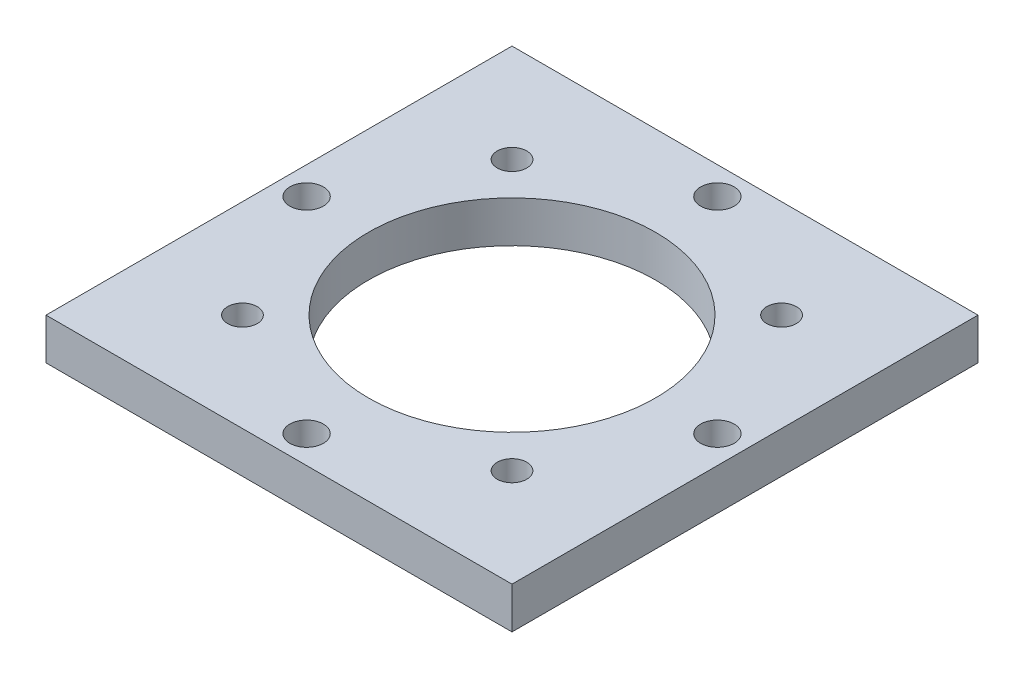
ISO-10303-21;
HEADER;
FILE_DESCRIPTION(('STEP AP214'),'2;1');
FILE_NAME('part.step','',(''),(''),'','','');
FILE_SCHEMA(('AUTOMOTIVE_DESIGN { 1 0 10303 214 1 1 1 1 }'));
ENDSEC;
DATA;
#1=APPLICATION_CONTEXT('core data for automotive mechanical design processes');
#2=APPLICATION_PROTOCOL_DEFINITION('international standard','automotive_design',2000,#1);
#3=PRODUCT_CONTEXT('',#1,'mechanical');
#4=PRODUCT('Part','Part','',(#3));
#5=PRODUCT_RELATED_PRODUCT_CATEGORY('part','',(#4));
#6=PRODUCT_DEFINITION_FORMATION('','',#4);
#7=PRODUCT_DEFINITION_CONTEXT('part definition',#1,'design');
#8=PRODUCT_DEFINITION('design','',#6,#7);
#9=PRODUCT_DEFINITION_SHAPE('','',#8);
#10=(LENGTH_UNIT() NAMED_UNIT(*) SI_UNIT(.MILLI.,.METRE.));
#11=(NAMED_UNIT(*) PLANE_ANGLE_UNIT() SI_UNIT($,.RADIAN.));
#12=(NAMED_UNIT(*) SI_UNIT($,.STERADIAN.) SOLID_ANGLE_UNIT());
#13=UNCERTAINTY_MEASURE_WITH_UNIT(LENGTH_MEASURE(1.E-05),#10,'distance_accuracy_value','');
#14=(GEOMETRIC_REPRESENTATION_CONTEXT(3) GLOBAL_UNCERTAINTY_ASSIGNED_CONTEXT((#13)) GLOBAL_UNIT_ASSIGNED_CONTEXT((#10,
#11,#12)) REPRESENTATION_CONTEXT('',''));
#15=CARTESIAN_POINT('',(0.,0.,0.));
#16=DIRECTION('',(0.,0.,1.));
#17=DIRECTION('',(1.,0.,0.));
#18=AXIS2_PLACEMENT_3D('',#15,#16,#17);
#19=CARTESIAN_POINT('',(0.,4.7625,0.));
#20=DIRECTION('',(0.,-1.,0.));
#21=DIRECTION('',(0.,0.,-1.));
#22=AXIS2_PLACEMENT_3D('',#19,#20,#21);
#23=PLANE('',#22);
#24=CARTESIAN_POINT('',(1.42049912535143E-12,4.7625,23.622));
#25=DIRECTION('',(0.,1.,0.));
#26=DIRECTION('',(0.,0.,1.));
#27=AXIS2_PLACEMENT_3D('',#24,#25,#26);
#28=CIRCLE('',#27,1.92664959529837);
#29=CARTESIAN_POINT('',(1.42049912535143E-12,4.7625,25.5486495952984));
#30=VERTEX_POINT('',#29);
#31=EDGE_CURVE('E160',#30,#30,#28,.T.);
#32=ORIENTED_EDGE('',*,*,#31,.F.);
#33=EDGE_LOOP('',(#32));
#34=FACE_BOUND('',#33,.T.);
#35=CARTESIAN_POINT('',(0.,4.7625,-23.622));
#36=DIRECTION('',(0.,1.,0.));
#37=DIRECTION('',(0.,0.,1.));
#38=AXIS2_PLACEMENT_3D('',#35,#36,#37);
#39=CIRCLE('',#38,1.92664959529838);
#40=CARTESIAN_POINT('',(0.,4.7625,-21.6953504047016));
#41=VERTEX_POINT('',#40);
#42=EDGE_CURVE('E146',#41,#41,#39,.T.);
#43=ORIENTED_EDGE('',*,*,#42,.F.);
#44=EDGE_LOOP('',(#43));
#45=FACE_BOUND('',#44,.T.);
#46=CARTESIAN_POINT('',(15.5,4.7625,15.5));
#47=DIRECTION('',(0.,1.,0.));
#48=DIRECTION('',(0.,0.,1.));
#49=AXIS2_PLACEMENT_3D('',#46,#47,#48);
#50=CIRCLE('',#49,1.7);
#51=CARTESIAN_POINT('',(15.5,4.7625,17.2));
#52=VERTEX_POINT('',#51);
#53=EDGE_CURVE('E133',#52,#52,#50,.T.);
#54=ORIENTED_EDGE('',*,*,#53,.F.);
#55=EDGE_LOOP('',(#54));
#56=FACE_BOUND('',#55,.T.);
#57=CARTESIAN_POINT('',(-15.5,4.7625,-15.5));
#58=DIRECTION('',(0.,1.,0.));
#59=DIRECTION('',(0.,0.,1.));
#60=AXIS2_PLACEMENT_3D('',#57,#58,#59);
#61=CIRCLE('',#60,1.7);
#62=CARTESIAN_POINT('',(-15.5,4.7625,-13.8));
#63=VERTEX_POINT('',#62);
#64=EDGE_CURVE('E121',#63,#63,#61,.T.);
#65=ORIENTED_EDGE('',*,*,#64,.F.);
#66=EDGE_LOOP('',(#65));
#67=FACE_BOUND('',#66,.T.);
#68=DIRECTION('',(0.,0.,-1.));
#69=VECTOR('',#68,1.);
#70=CARTESIAN_POINT('',(26.797,4.7625,26.797));
#71=LINE('',#70,#69);
#72=CARTESIAN_POINT('',(26.797,4.7625,26.797));
#73=VERTEX_POINT('',#72);
#74=CARTESIAN_POINT('',(26.797,4.7625,-26.797));
#75=VERTEX_POINT('',#74);
#76=EDGE_CURVE('E84',#73,#75,#71,.T.);
#77=ORIENTED_EDGE('',*,*,#76,.T.);
#78=DIRECTION('',(-1.,0.,0.));
#79=VECTOR('',#78,1.);
#80=CARTESIAN_POINT('',(-26.797,4.7625,-26.797));
#81=LINE('',#80,#79);
#82=CARTESIAN_POINT('',(-26.797,4.7625,-26.797));
#83=VERTEX_POINT('',#82);
#84=EDGE_CURVE('E79',#75,#83,#81,.T.);
#85=ORIENTED_EDGE('',*,*,#84,.T.);
#86=DIRECTION('',(0.,0.,1.));
#87=VECTOR('',#86,1.);
#88=CARTESIAN_POINT('',(-26.797,4.7625,26.797));
#89=LINE('',#88,#87);
#90=CARTESIAN_POINT('',(-26.797,4.7625,26.797));
#91=VERTEX_POINT('',#90);
#92=EDGE_CURVE('E82',#83,#91,#89,.T.);
#93=ORIENTED_EDGE('',*,*,#92,.T.);
#94=DIRECTION('',(1.,0.,0.));
#95=VECTOR('',#94,1.);
#96=CARTESIAN_POINT('',(-26.797,4.7625,26.797));
#97=LINE('',#96,#95);
#98=EDGE_CURVE('E49',#91,#73,#97,.T.);
#99=ORIENTED_EDGE('',*,*,#98,.T.);
#100=EDGE_LOOP('',(#77,#85,#93,#99));
#101=FACE_BOUND('',#100,.T.);
#102=CARTESIAN_POINT('',(0.,4.7625,0.));
#103=DIRECTION('',(0.,1.,0.));
#104=DIRECTION('',(0.,0.,1.));
#105=AXIS2_PLACEMENT_3D('',#102,#103,#104);
#106=CIRCLE('',#105,16.51);
#107=CARTESIAN_POINT('',(0.,4.7625,16.51));
#108=VERTEX_POINT('',#107);
#109=EDGE_CURVE('E104',#108,#108,#106,.T.);
#110=ORIENTED_EDGE('',*,*,#109,.F.);
#111=EDGE_LOOP('',(#110));
#112=FACE_BOUND('',#111,.T.);
#113=CARTESIAN_POINT('',(15.5,4.7625,-15.5));
#114=DIRECTION('',(0.,1.,0.));
#115=DIRECTION('',(0.,0.,1.));
#116=AXIS2_PLACEMENT_3D('',#113,#114,#115);
#117=CIRCLE('',#116,1.7);
#118=CARTESIAN_POINT('',(15.5,4.7625,-13.8));
#119=VERTEX_POINT('',#118);
#120=EDGE_CURVE('E127',#119,#119,#117,.T.);
#121=ORIENTED_EDGE('',*,*,#120,.F.);
#122=EDGE_LOOP('',(#121));
#123=FACE_BOUND('',#122,.T.);
#124=CARTESIAN_POINT('',(-15.5,4.7625,15.5));
#125=DIRECTION('',(0.,1.,0.));
#126=DIRECTION('',(0.,0.,1.));
#127=AXIS2_PLACEMENT_3D('',#124,#125,#126);
#128=CIRCLE('',#127,1.7);
#129=CARTESIAN_POINT('',(-15.5,4.7625,17.2));
#130=VERTEX_POINT('',#129);
#131=EDGE_CURVE('E139',#130,#130,#128,.T.);
#132=ORIENTED_EDGE('',*,*,#131,.F.);
#133=EDGE_LOOP('',(#132));
#134=FACE_BOUND('',#133,.T.);
#135=CARTESIAN_POINT('',(23.6220000000007,4.7625,-7.12396282621754E-13));
#136=DIRECTION('',(0.,1.,0.));
#137=DIRECTION('',(0.,0.,1.));
#138=AXIS2_PLACEMENT_3D('',#135,#136,#137);
#139=CIRCLE('',#138,1.92664959529838);
#140=CARTESIAN_POINT('',(23.6220000000007,4.7625,1.92664959529766));
#141=VERTEX_POINT('',#140);
#142=EDGE_CURVE('E153',#141,#141,#139,.T.);
#143=ORIENTED_EDGE('',*,*,#142,.F.);
#144=EDGE_LOOP('',(#143));
#145=FACE_BOUND('',#144,.T.);
#146=CARTESIAN_POINT('',(-23.6219999999993,4.7625,7.152891432907E-13));
#147=DIRECTION('',(0.,1.,0.));
#148=DIRECTION('',(0.,0.,1.));
#149=AXIS2_PLACEMENT_3D('',#146,#147,#148);
#150=CIRCLE('',#149,1.92664959529838);
#151=CARTESIAN_POINT('',(-23.6219999999993,4.7625,1.92664959529909));
#152=VERTEX_POINT('',#151);
#153=EDGE_CURVE('E167',#152,#152,#150,.T.);
#154=ORIENTED_EDGE('',*,*,#153,.F.);
#155=EDGE_LOOP('',(#154));
#156=FACE_BOUND('',#155,.T.);
#157=ADVANCED_FACE('F32',(#34,#45,#56,#67,#101,#112,#123,#134,#145,#156),#23,.F.);
#158=CARTESIAN_POINT('',(0.,0.,0.));
#159=DIRECTION('',(0.,-1.,0.));
#160=DIRECTION('',(0.,0.,-1.));
#161=AXIS2_PLACEMENT_3D('',#158,#159,#160);
#162=PLANE('',#161);
#163=CARTESIAN_POINT('',(1.42049912535143E-12,0.,23.622));
#164=DIRECTION('',(0.,1.,0.));
#165=DIRECTION('',(0.,0.,1.));
#166=AXIS2_PLACEMENT_3D('',#163,#164,#165);
#167=CIRCLE('',#166,1.92664959529837);
#168=CARTESIAN_POINT('',(1.42049912535143E-12,0.,25.5486495952984));
#169=VERTEX_POINT('',#168);
#170=EDGE_CURVE('E163',#169,#169,#167,.T.);
#171=ORIENTED_EDGE('',*,*,#170,.T.);
#172=EDGE_LOOP('',(#171));
#173=FACE_BOUND('',#172,.T.);
#174=CARTESIAN_POINT('',(0.,0.,-23.622));
#175=DIRECTION('',(0.,1.,0.));
#176=DIRECTION('',(0.,0.,1.));
#177=AXIS2_PLACEMENT_3D('',#174,#175,#176);
#178=CIRCLE('',#177,1.92664959529838);
#179=CARTESIAN_POINT('',(0.,0.,-21.6953504047016));
#180=VERTEX_POINT('',#179);
#181=EDGE_CURVE('E149',#180,#180,#178,.T.);
#182=ORIENTED_EDGE('',*,*,#181,.T.);
#183=EDGE_LOOP('',(#182));
#184=FACE_BOUND('',#183,.T.);
#185=CARTESIAN_POINT('',(15.5,0.,15.5));
#186=DIRECTION('',(0.,1.,0.));
#187=DIRECTION('',(0.,0.,1.));
#188=AXIS2_PLACEMENT_3D('',#185,#186,#187);
#189=CIRCLE('',#188,1.7);
#190=CARTESIAN_POINT('',(15.5,0.,17.2));
#191=VERTEX_POINT('',#190);
#192=EDGE_CURVE('E136',#191,#191,#189,.T.);
#193=ORIENTED_EDGE('',*,*,#192,.T.);
#194=EDGE_LOOP('',(#193));
#195=FACE_BOUND('',#194,.T.);
#196=CARTESIAN_POINT('',(-15.5,0.,-15.5));
#197=DIRECTION('',(0.,1.,0.));
#198=DIRECTION('',(0.,0.,1.));
#199=AXIS2_PLACEMENT_3D('',#196,#197,#198);
#200=CIRCLE('',#199,1.7);
#201=CARTESIAN_POINT('',(-15.5,0.,-13.8));
#202=VERTEX_POINT('',#201);
#203=EDGE_CURVE('E124',#202,#202,#200,.T.);
#204=ORIENTED_EDGE('',*,*,#203,.T.);
#205=EDGE_LOOP('',(#204));
#206=FACE_BOUND('',#205,.T.);
#207=DIRECTION('',(0.,0.,-1.));
#208=VECTOR('',#207,1.);
#209=CARTESIAN_POINT('',(26.797,0.,26.797));
#210=LINE('',#209,#208);
#211=CARTESIAN_POINT('',(26.797,0.,26.797));
#212=VERTEX_POINT('',#211);
#213=CARTESIAN_POINT('',(26.797,0.,-26.797));
#214=VERTEX_POINT('',#213);
#215=EDGE_CURVE('E100',#212,#214,#210,.T.);
#216=ORIENTED_EDGE('',*,*,#215,.F.);
#217=DIRECTION('',(1.,0.,0.));
#218=VECTOR('',#217,1.);
#219=CARTESIAN_POINT('',(-26.797,0.,26.797));
#220=LINE('',#219,#218);
#221=CARTESIAN_POINT('',(-26.797,0.,26.797));
#222=VERTEX_POINT('',#221);
#223=EDGE_CURVE('E72',#222,#212,#220,.T.);
#224=ORIENTED_EDGE('',*,*,#223,.F.);
#225=DIRECTION('',(0.,0.,1.));
#226=VECTOR('',#225,1.);
#227=CARTESIAN_POINT('',(-26.797,0.,26.797));
#228=LINE('',#227,#226);
#229=CARTESIAN_POINT('',(-26.797,0.,-26.797));
#230=VERTEX_POINT('',#229);
#231=EDGE_CURVE('E66',#230,#222,#228,.T.);
#232=ORIENTED_EDGE('',*,*,#231,.F.);
#233=DIRECTION('',(-1.,0.,0.));
#234=VECTOR('',#233,1.);
#235=CARTESIAN_POINT('',(-26.797,0.,-26.797));
#236=LINE('',#235,#234);
#237=EDGE_CURVE('E88',#214,#230,#236,.T.);
#238=ORIENTED_EDGE('',*,*,#237,.F.);
#239=EDGE_LOOP('',(#216,#224,#232,#238));
#240=FACE_BOUND('',#239,.T.);
#241=CARTESIAN_POINT('',(0.,0.,0.));
#242=DIRECTION('',(0.,1.,0.));
#243=DIRECTION('',(0.,0.,1.));
#244=AXIS2_PLACEMENT_3D('',#241,#242,#243);
#245=CIRCLE('',#244,16.51);
#246=CARTESIAN_POINT('',(0.,0.,16.51));
#247=VERTEX_POINT('',#246);
#248=EDGE_CURVE('E118',#247,#247,#245,.T.);
#249=ORIENTED_EDGE('',*,*,#248,.T.);
#250=EDGE_LOOP('',(#249));
#251=FACE_BOUND('',#250,.T.);
#252=CARTESIAN_POINT('',(15.5,0.,-15.5));
#253=DIRECTION('',(0.,1.,0.));
#254=DIRECTION('',(0.,0.,1.));
#255=AXIS2_PLACEMENT_3D('',#252,#253,#254);
#256=CIRCLE('',#255,1.7);
#257=CARTESIAN_POINT('',(15.5,0.,-13.8));
#258=VERTEX_POINT('',#257);
#259=EDGE_CURVE('E130',#258,#258,#256,.T.);
#260=ORIENTED_EDGE('',*,*,#259,.T.);
#261=EDGE_LOOP('',(#260));
#262=FACE_BOUND('',#261,.T.);
#263=CARTESIAN_POINT('',(-15.5,0.,15.5));
#264=DIRECTION('',(0.,1.,0.));
#265=DIRECTION('',(0.,0.,1.));
#266=AXIS2_PLACEMENT_3D('',#263,#264,#265);
#267=CIRCLE('',#266,1.7);
#268=CARTESIAN_POINT('',(-15.5,0.,17.2));
#269=VERTEX_POINT('',#268);
#270=EDGE_CURVE('E143',#269,#269,#267,.T.);
#271=ORIENTED_EDGE('',*,*,#270,.T.);
#272=EDGE_LOOP('',(#271));
#273=FACE_BOUND('',#272,.T.);
#274=CARTESIAN_POINT('',(23.6220000000007,0.,-7.12396282621754E-13));
#275=DIRECTION('',(0.,1.,0.));
#276=DIRECTION('',(0.,0.,1.));
#277=AXIS2_PLACEMENT_3D('',#274,#275,#276);
#278=CIRCLE('',#277,1.92664959529838);
#279=CARTESIAN_POINT('',(23.6220000000007,0.,1.92664959529766));
#280=VERTEX_POINT('',#279);
#281=EDGE_CURVE('E156',#280,#280,#278,.T.);
#282=ORIENTED_EDGE('',*,*,#281,.T.);
#283=EDGE_LOOP('',(#282));
#284=FACE_BOUND('',#283,.T.);
#285=CARTESIAN_POINT('',(-23.6219999999993,0.,7.152891432907E-13));
#286=DIRECTION('',(0.,1.,0.));
#287=DIRECTION('',(0.,0.,1.));
#288=AXIS2_PLACEMENT_3D('',#285,#286,#287);
#289=CIRCLE('',#288,1.92664959529838);
#290=CARTESIAN_POINT('',(-23.6219999999993,0.,1.92664959529909));
#291=VERTEX_POINT('',#290);
#292=EDGE_CURVE('E170',#291,#291,#289,.T.);
#293=ORIENTED_EDGE('',*,*,#292,.T.);
#294=EDGE_LOOP('',(#293));
#295=FACE_BOUND('',#294,.T.);
#296=ADVANCED_FACE('F114',(#173,#184,#195,#206,#240,#251,#262,#273,#284,#295),#162,.T.);
#297=CARTESIAN_POINT('',(26.797,4.7625,26.797));
#298=DIRECTION('',(-1.,0.,0.));
#299=DIRECTION('',(0.,0.,1.));
#300=AXIS2_PLACEMENT_3D('',#297,#298,#299);
#301=PLANE('',#300);
#302=ORIENTED_EDGE('',*,*,#215,.T.);
#303=DIRECTION('',(0.,-1.,0.));
#304=VECTOR('',#303,1.);
#305=CARTESIAN_POINT('',(26.797,4.7625,-26.797));
#306=LINE('',#305,#304);
#307=EDGE_CURVE('E11',#75,#214,#306,.T.);
#308=ORIENTED_EDGE('',*,*,#307,.F.);
#309=ORIENTED_EDGE('',*,*,#76,.F.);
#310=DIRECTION('',(0.,-1.,0.));
#311=VECTOR('',#310,1.);
#312=CARTESIAN_POINT('',(26.797,4.7625,26.797));
#313=LINE('',#312,#311);
#314=EDGE_CURVE('E96',#73,#212,#313,.T.);
#315=ORIENTED_EDGE('',*,*,#314,.T.);
#316=EDGE_LOOP('',(#302,#308,#309,#315));
#317=FACE_BOUND('',#316,.T.);
#318=ADVANCED_FACE('F34',(#317),#301,.F.);
#319=CARTESIAN_POINT('',(-26.797,4.7625,-26.797));
#320=DIRECTION('',(0.,0.,1.));
#321=DIRECTION('',(1.,0.,0.));
#322=AXIS2_PLACEMENT_3D('',#319,#320,#321);
#323=PLANE('',#322);
#324=ORIENTED_EDGE('',*,*,#237,.T.);
#325=DIRECTION('',(0.,-1.,0.));
#326=VECTOR('',#325,1.);
#327=CARTESIAN_POINT('',(-26.797,4.7625,-26.797));
#328=LINE('',#327,#326);
#329=EDGE_CURVE('E41',#83,#230,#328,.T.);
#330=ORIENTED_EDGE('',*,*,#329,.F.);
#331=ORIENTED_EDGE('',*,*,#84,.F.);
#332=ORIENTED_EDGE('',*,*,#307,.T.);
#333=EDGE_LOOP('',(#324,#330,#331,#332));
#334=FACE_BOUND('',#333,.T.);
#335=ADVANCED_FACE('F87',(#334),#323,.F.);
#336=CARTESIAN_POINT('',(-26.797,4.7625,26.797));
#337=DIRECTION('',(1.,0.,0.));
#338=DIRECTION('',(0.,0.,-1.));
#339=AXIS2_PLACEMENT_3D('',#336,#337,#338);
#340=PLANE('',#339);
#341=ORIENTED_EDGE('',*,*,#231,.T.);
#342=DIRECTION('',(0.,-1.,0.));
#343=VECTOR('',#342,1.);
#344=CARTESIAN_POINT('',(-26.797,4.7625,26.797));
#345=LINE('',#344,#343);
#346=EDGE_CURVE('E89',#91,#222,#345,.T.);
#347=ORIENTED_EDGE('',*,*,#346,.F.);
#348=ORIENTED_EDGE('',*,*,#92,.F.);
#349=ORIENTED_EDGE('',*,*,#329,.T.);
#350=EDGE_LOOP('',(#341,#347,#348,#349));
#351=FACE_BOUND('',#350,.T.);
#352=ADVANCED_FACE('F90',(#351),#340,.F.);
#353=CARTESIAN_POINT('',(-26.797,4.7625,26.797));
#354=DIRECTION('',(0.,0.,-1.));
#355=DIRECTION('',(-1.,0.,0.));
#356=AXIS2_PLACEMENT_3D('',#353,#354,#355);
#357=PLANE('',#356);
#358=ORIENTED_EDGE('',*,*,#223,.T.);
#359=ORIENTED_EDGE('',*,*,#314,.F.);
#360=ORIENTED_EDGE('',*,*,#98,.F.);
#361=ORIENTED_EDGE('',*,*,#346,.T.);
#362=EDGE_LOOP('',(#358,#359,#360,#361));
#363=FACE_BOUND('',#362,.T.);
#364=ADVANCED_FACE('F111',(#363),#357,.F.);
#365=CARTESIAN_POINT('',(0.,4.7625,0.));
#366=DIRECTION('',(0.,-1.,0.));
#367=DIRECTION('',(0.,0.,-1.));
#368=AXIS2_PLACEMENT_3D('',#365,#366,#367);
#369=CYLINDRICAL_SURFACE('',#368,16.51);
#370=ORIENTED_EDGE('',*,*,#109,.T.);
#371=EDGE_LOOP('',(#370));
#372=FACE_BOUND('',#371,.T.);
#373=ORIENTED_EDGE('',*,*,#248,.F.);
#374=EDGE_LOOP('',(#373));
#375=FACE_BOUND('',#374,.T.);
#376=ADVANCED_FACE('F191',(#372,#375),#369,.F.);
#377=CARTESIAN_POINT('',(-15.5,4.7625,-15.5));
#378=DIRECTION('',(0.,-1.,0.));
#379=DIRECTION('',(0.,0.,-1.));
#380=AXIS2_PLACEMENT_3D('',#377,#378,#379);
#381=CYLINDRICAL_SURFACE('',#380,1.7);
#382=ORIENTED_EDGE('',*,*,#64,.T.);
#383=EDGE_LOOP('',(#382));
#384=FACE_BOUND('',#383,.T.);
#385=ORIENTED_EDGE('',*,*,#203,.F.);
#386=EDGE_LOOP('',(#385));
#387=FACE_BOUND('',#386,.T.);
#388=ADVANCED_FACE('F250',(#384,#387),#381,.F.);
#389=CARTESIAN_POINT('',(15.5,4.7625,-15.5));
#390=DIRECTION('',(0.,-1.,0.));
#391=DIRECTION('',(0.,0.,-1.));
#392=AXIS2_PLACEMENT_3D('',#389,#390,#391);
#393=CYLINDRICAL_SURFACE('',#392,1.7);
#394=ORIENTED_EDGE('',*,*,#120,.T.);
#395=EDGE_LOOP('',(#394));
#396=FACE_BOUND('',#395,.T.);
#397=ORIENTED_EDGE('',*,*,#259,.F.);
#398=EDGE_LOOP('',(#397));
#399=FACE_BOUND('',#398,.T.);
#400=ADVANCED_FACE('F245',(#396,#399),#393,.F.);
#401=CARTESIAN_POINT('',(15.5,4.7625,15.5));
#402=DIRECTION('',(0.,-1.,0.));
#403=DIRECTION('',(0.,0.,-1.));
#404=AXIS2_PLACEMENT_3D('',#401,#402,#403);
#405=CYLINDRICAL_SURFACE('',#404,1.7);
#406=ORIENTED_EDGE('',*,*,#53,.T.);
#407=EDGE_LOOP('',(#406));
#408=FACE_BOUND('',#407,.T.);
#409=ORIENTED_EDGE('',*,*,#192,.F.);
#410=EDGE_LOOP('',(#409));
#411=FACE_BOUND('',#410,.T.);
#412=ADVANCED_FACE('F219',(#408,#411),#405,.F.);
#413=CARTESIAN_POINT('',(-15.5,4.7625,15.5));
#414=DIRECTION('',(0.,-1.,0.));
#415=DIRECTION('',(0.,0.,-1.));
#416=AXIS2_PLACEMENT_3D('',#413,#414,#415);
#417=CYLINDRICAL_SURFACE('',#416,1.7);
#418=ORIENTED_EDGE('',*,*,#131,.T.);
#419=EDGE_LOOP('',(#418));
#420=FACE_BOUND('',#419,.T.);
#421=ORIENTED_EDGE('',*,*,#270,.F.);
#422=EDGE_LOOP('',(#421));
#423=FACE_BOUND('',#422,.T.);
#424=ADVANCED_FACE('F304',(#420,#423),#417,.F.);
#425=CARTESIAN_POINT('',(0.,4.7625,-23.622));
#426=DIRECTION('',(0.,-1.,0.));
#427=DIRECTION('',(0.,0.,-1.));
#428=AXIS2_PLACEMENT_3D('',#425,#426,#427);
#429=CYLINDRICAL_SURFACE('',#428,1.92664959529838);
#430=ORIENTED_EDGE('',*,*,#42,.T.);
#431=EDGE_LOOP('',(#430));
#432=FACE_BOUND('',#431,.T.);
#433=ORIENTED_EDGE('',*,*,#181,.F.);
#434=EDGE_LOOP('',(#433));
#435=FACE_BOUND('',#434,.T.);
#436=ADVANCED_FACE('F270',(#432,#435),#429,.F.);
#437=CARTESIAN_POINT('',(23.6220000000007,4.7625,-7.12396282621754E-13));
#438=DIRECTION('',(0.,-1.,0.));
#439=DIRECTION('',(0.,0.,-1.));
#440=AXIS2_PLACEMENT_3D('',#437,#438,#439);
#441=CYLINDRICAL_SURFACE('',#440,1.92664959529838);
#442=ORIENTED_EDGE('',*,*,#142,.T.);
#443=EDGE_LOOP('',(#442));
#444=FACE_BOUND('',#443,.T.);
#445=ORIENTED_EDGE('',*,*,#281,.F.);
#446=EDGE_LOOP('',(#445));
#447=FACE_BOUND('',#446,.T.);
#448=ADVANCED_FACE('F265',(#444,#447),#441,.F.);
#449=CARTESIAN_POINT('',(1.42049912535143E-12,4.7625,23.622));
#450=DIRECTION('',(0.,-1.,0.));
#451=DIRECTION('',(0.,0.,-1.));
#452=AXIS2_PLACEMENT_3D('',#449,#450,#451);
#453=CYLINDRICAL_SURFACE('',#452,1.92664959529837);
#454=ORIENTED_EDGE('',*,*,#31,.T.);
#455=EDGE_LOOP('',(#454));
#456=FACE_BOUND('',#455,.T.);
#457=ORIENTED_EDGE('',*,*,#170,.F.);
#458=EDGE_LOOP('',(#457));
#459=FACE_BOUND('',#458,.T.);
#460=ADVANCED_FACE('F269',(#456,#459),#453,.F.);
#461=CARTESIAN_POINT('',(-23.6219999999993,4.7625,7.152891432907E-13));
#462=DIRECTION('',(0.,-1.,0.));
#463=DIRECTION('',(0.,0.,-1.));
#464=AXIS2_PLACEMENT_3D('',#461,#462,#463);
#465=CYLINDRICAL_SURFACE('',#464,1.92664959529838);
#466=ORIENTED_EDGE('',*,*,#153,.T.);
#467=EDGE_LOOP('',(#466));
#468=FACE_BOUND('',#467,.T.);
#469=ORIENTED_EDGE('',*,*,#292,.F.);
#470=EDGE_LOOP('',(#469));
#471=FACE_BOUND('',#470,.T.);
#472=ADVANCED_FACE('F177',(#468,#471),#465,.F.);
#473=CLOSED_SHELL('',(#157,#296,#318,#335,#352,#364,#376,#388,#400,#412,#424,#436,#448,#460,#472));
#474=MANIFOLD_SOLID_BREP('B2',#473);
#475=ADVANCED_BREP_SHAPE_REPRESENTATION('',(#18,#474),#14);
#476=SHAPE_DEFINITION_REPRESENTATION(#9,#475);
ENDSEC;
END-ISO-10303-21;
